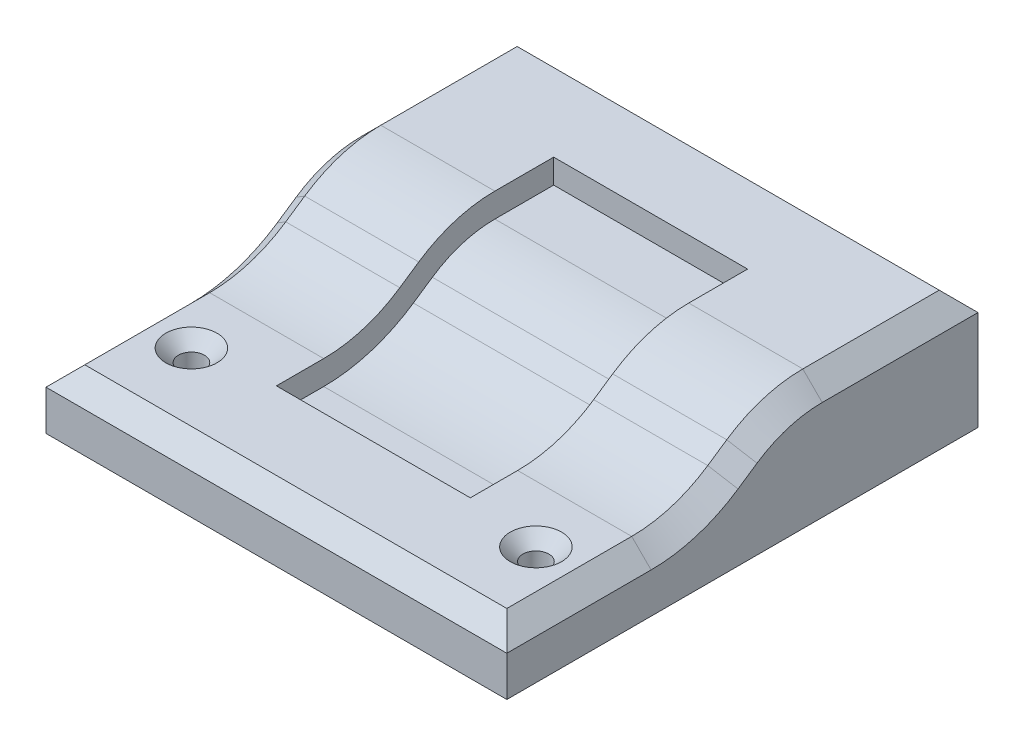
ISO-10303-21;
HEADER;
FILE_DESCRIPTION(('STEP AP214'),'2;1');
FILE_NAME('part.step','',(''),(''),'','','');
FILE_SCHEMA(('AUTOMOTIVE_DESIGN { 1 0 10303 214 1 1 1 1 }'));
ENDSEC;
DATA;
#1=APPLICATION_CONTEXT('core data for automotive mechanical design processes');
#2=APPLICATION_PROTOCOL_DEFINITION('international standard','automotive_design',2000,#1);
#3=PRODUCT_CONTEXT('',#1,'mechanical');
#4=PRODUCT('Part','Part','',(#3));
#5=PRODUCT_RELATED_PRODUCT_CATEGORY('part','',(#4));
#6=PRODUCT_DEFINITION_FORMATION('','',#4);
#7=PRODUCT_DEFINITION_CONTEXT('part definition',#1,'design');
#8=PRODUCT_DEFINITION('design','',#6,#7);
#9=PRODUCT_DEFINITION_SHAPE('','',#8);
#10=(LENGTH_UNIT() NAMED_UNIT(*) SI_UNIT(.MILLI.,.METRE.));
#11=(NAMED_UNIT(*) PLANE_ANGLE_UNIT() SI_UNIT($,.RADIAN.));
#12=(NAMED_UNIT(*) SI_UNIT($,.STERADIAN.) SOLID_ANGLE_UNIT());
#13=UNCERTAINTY_MEASURE_WITH_UNIT(LENGTH_MEASURE(1.E-05),#10,'distance_accuracy_value','');
#14=(GEOMETRIC_REPRESENTATION_CONTEXT(3) GLOBAL_UNCERTAINTY_ASSIGNED_CONTEXT((#13)) GLOBAL_UNIT_ASSIGNED_CONTEXT((#10,
#11,#12)) REPRESENTATION_CONTEXT('',''));
#15=CARTESIAN_POINT('',(0.,0.,0.));
#16=DIRECTION('',(0.,0.,1.));
#17=DIRECTION('',(1.,0.,0.));
#18=AXIS2_PLACEMENT_3D('',#15,#16,#17);
#19=CARTESIAN_POINT('',(-30.1832605408554,0.,37.3732017788698));
#20=DIRECTION('',(0.,-0.828233282410812,-0.560383466839461));
#21=DIRECTION('',(0.,0.560383466839461,-0.828233282410812));
#22=AXIS2_PLACEMENT_3D('',#19,#20,#21);
#23=PLANE('',#22);
#24=DIRECTION('',(1.,0.,0.));
#25=VECTOR('',#24,1.);
#26=CARTESIAN_POINT('',(-30.1832605408554,4.73659344972689,30.3726306120607));
#27=LINE('',#26,#25);
#28=CARTESIAN_POINT('',(27.6432605408554,4.73659344972689,30.3726306120607));
#29=VERTEX_POINT('',#28);
#30=CARTESIAN_POINT('',(12.7,4.73659344972689,30.3726306120607));
#31=VERTEX_POINT('',#30);
#32=EDGE_CURVE('E516',#29,#31,#27,.F.);
#33=ORIENTED_EDGE('',*,*,#32,.T.);
#34=DIRECTION('',(0.,-0.560383466839461,0.828233282410812));
#35=VECTOR('',#34,1.);
#36=CARTESIAN_POINT('',(12.7,0.,37.3732017788698));
#37=LINE('',#36,#35);
#38=CARTESIAN_POINT('',(12.7,3.05401223873577,32.8594451627497));
#39=VERTEX_POINT('',#38);
#40=EDGE_CURVE('E464',#31,#39,#37,.T.);
#41=ORIENTED_EDGE('',*,*,#40,.T.);
#42=DIRECTION('',(1.,0.,0.));
#43=VECTOR('',#42,1.);
#44=CARTESIAN_POINT('',(30.1832605408554,3.05401223873577,32.8594451627497));
#45=LINE('',#44,#43);
#46=CARTESIAN_POINT('',(27.6432605408554,3.05401223873577,32.8594451627497));
#47=VERTEX_POINT('',#46);
#48=EDGE_CURVE('E519',#39,#47,#45,.T.);
#49=ORIENTED_EDGE('',*,*,#48,.T.);
#50=DIRECTION('',(0.,0.560383466839461,-0.828233282410812));
#51=VECTOR('',#50,1.);
#52=CARTESIAN_POINT('',(27.6432605408554,0.,37.3732017788698));
#53=LINE('',#52,#51);
#54=EDGE_CURVE('E569',#47,#29,#53,.T.);
#55=ORIENTED_EDGE('',*,*,#54,.T.);
#56=EDGE_LOOP('',(#33,#41,#49,#55));
#57=FACE_BOUND('',#56,.T.);
#58=ADVANCED_FACE('F240',(#57),#23,.F.);
#59=CARTESIAN_POINT('',(-30.1832605408554,17.78,42.8230632031553));
#60=DIRECTION('',(-1.,0.,0.));
#61=DIRECTION('',(0.,0.,1.));
#62=AXIS2_PLACEMENT_3D('',#59,#60,#61);
#63=CYLINDRICAL_SURFACE('',#62,17.78);
#64=ORIENTED_EDGE('',*,*,#48,.F.);
#65=CARTESIAN_POINT('',(12.7,17.78,42.8230632031553));
#66=DIRECTION('',(1.,0.,0.));
#67=DIRECTION('',(0.,0.,-1.));
#68=AXIS2_PLACEMENT_3D('',#65,#66,#67);
#69=CIRCLE('',#68,17.78);
#70=CARTESIAN_POINT('',(12.7,0.,42.8230632031553));
#71=VERTEX_POINT('',#70);
#72=EDGE_CURVE('E470',#39,#71,#69,.F.);
#73=ORIENTED_EDGE('',*,*,#72,.T.);
#74=DIRECTION('',(1.,0.,0.));
#75=VECTOR('',#74,1.);
#76=CARTESIAN_POINT('',(-30.1832605408554,0.,42.8230632031553));
#77=LINE('',#76,#75);
#78=CARTESIAN_POINT('',(27.6432605408554,0.,42.8230632031553));
#79=VERTEX_POINT('',#78);
#80=EDGE_CURVE('E524',#79,#71,#77,.F.);
#81=ORIENTED_EDGE('',*,*,#80,.F.);
#82=CARTESIAN_POINT('',(27.6432605408554,17.78,42.8230632031553));
#83=DIRECTION('',(-1.,0.,0.));
#84=DIRECTION('',(0.,0.,1.));
#85=AXIS2_PLACEMENT_3D('',#82,#83,#84);
#86=CIRCLE('',#85,17.78);
#87=EDGE_CURVE('E564',#79,#47,#86,.F.);
#88=ORIENTED_EDGE('',*,*,#87,.T.);
#89=EDGE_LOOP('',(#64,#73,#81,#88));
#90=FACE_BOUND('',#89,.T.);
#91=ADVANCED_FACE('F625',(#90),#63,.F.);
#92=CARTESIAN_POINT('',(30.1832605408554,-9.98939431153734,20.4090125716551));
#93=DIRECTION('',(1.,0.,0.));
#94=DIRECTION('',(0.,0.,-1.));
#95=AXIS2_PLACEMENT_3D('',#92,#93,#94);
#96=CYLINDRICAL_SURFACE('',#95,17.78);
#97=CARTESIAN_POINT('',(12.7,-9.98939431153734,20.4090125716551));
#98=DIRECTION('',(1.,0.,0.));
#99=DIRECTION('',(0.,0.,-1.));
#100=AXIS2_PLACEMENT_3D('',#97,#98,#99);
#101=CIRCLE('',#100,17.78);
#102=CARTESIAN_POINT('',(12.7,7.79060568846266,20.4090125716551));
#103=VERTEX_POINT('',#102);
#104=EDGE_CURVE('E618',#31,#103,#101,.F.);
#105=ORIENTED_EDGE('',*,*,#104,.F.);
#106=ORIENTED_EDGE('',*,*,#32,.F.);
#107=CARTESIAN_POINT('',(27.6432605408554,-9.98939431153734,20.4090125716551));
#108=DIRECTION('',(-1.,0.,0.));
#109=DIRECTION('',(0.,0.,1.));
#110=AXIS2_PLACEMENT_3D('',#107,#108,#109);
#111=CIRCLE('',#110,17.78);
#112=CARTESIAN_POINT('',(27.6432605408554,7.79060568846265,20.4090125716551));
#113=VERTEX_POINT('',#112);
#114=EDGE_CURVE('E574',#29,#113,#111,.T.);
#115=ORIENTED_EDGE('',*,*,#114,.T.);
#116=DIRECTION('',(1.,0.,0.));
#117=VECTOR('',#116,1.);
#118=CARTESIAN_POINT('',(30.1832605408554,7.79060568846265,20.4090125716551));
#119=LINE('',#118,#117);
#120=EDGE_CURVE('E527',#103,#113,#119,.T.);
#121=ORIENTED_EDGE('',*,*,#120,.F.);
#122=EDGE_LOOP('',(#105,#106,#115,#121));
#123=FACE_BOUND('',#122,.T.);
#124=ADVANCED_FACE('F633',(#123),#96,.T.);
#125=CARTESIAN_POINT('',(-30.1832605408554,7.79060568846265,61.722));
#126=DIRECTION('',(1.,0.,0.));
#127=DIRECTION('',(0.,0.,-1.));
#128=AXIS2_PLACEMENT_3D('',#125,#126,#127);
#129=PLANE('',#128);
#130=DIRECTION('',(0.,-1.,0.));
#131=VECTOR('',#130,1.);
#132=CARTESIAN_POINT('',(-30.1832605408554,7.79060568846265,61.722));
#133=LINE('',#132,#131);
#134=CARTESIAN_POINT('',(-30.1832605408554,-2.53999999999999,61.722));
#135=VERTEX_POINT('',#134);
#136=CARTESIAN_POINT('',(-30.1832605408554,-7.79060568846265,61.722));
#137=VERTEX_POINT('',#136);
#138=EDGE_CURVE('E496',#135,#137,#133,.T.);
#139=ORIENTED_EDGE('',*,*,#138,.F.);
#140=DIRECTION('',(0.,0.,-1.));
#141=VECTOR('',#140,1.);
#142=CARTESIAN_POINT('',(-30.1832605408554,-2.53999999999999,61.722));
#143=LINE('',#142,#141);
#144=CARTESIAN_POINT('',(-30.1832605408554,-2.53999999999999,42.8230632031553));
#145=VERTEX_POINT('',#144);
#146=EDGE_CURVE('E559',#135,#145,#143,.T.);
#147=ORIENTED_EDGE('',*,*,#146,.T.);
#148=CARTESIAN_POINT('',(-30.1832605408554,17.78,42.8230632031553));
#149=DIRECTION('',(1.,0.,0.));
#150=DIRECTION('',(0.,0.,-1.));
#151=AXIS2_PLACEMENT_3D('',#148,#149,#150);
#152=CIRCLE('',#151,20.32);
#153=CARTESIAN_POINT('',(-30.1832605408554,0.950299701412311,31.4360711569775));
#154=VERTEX_POINT('',#153);
#155=EDGE_CURVE('E557',#145,#154,#152,.T.);
#156=ORIENTED_EDGE('',*,*,#155,.T.);
#157=DIRECTION('',(0.,0.560383466839461,-0.828233282410812));
#158=VECTOR('',#157,1.);
#159=CARTESIAN_POINT('',(-30.1832605408554,-10.9581963356475,49.0365418078644));
#160=LINE('',#159,#158);
#161=CARTESIAN_POINT('',(-30.1832605408554,2.63288091240343,28.9492566062885));
#162=VERTEX_POINT('',#161);
#163=EDGE_CURVE('E555',#154,#162,#160,.T.);
#164=ORIENTED_EDGE('',*,*,#163,.T.);
#165=CARTESIAN_POINT('',(-30.1832605408554,-9.98939431153734,20.4090125716551));
#166=DIRECTION('',(1.,0.,0.));
#167=DIRECTION('',(0.,0.,-1.));
#168=AXIS2_PLACEMENT_3D('',#165,#166,#167);
#169=CIRCLE('',#168,15.24);
#170=CARTESIAN_POINT('',(-30.1832605408554,5.25060568846266,20.4090125716551));
#171=VERTEX_POINT('',#170);
#172=EDGE_CURVE('E553',#162,#171,#169,.F.);
#173=ORIENTED_EDGE('',*,*,#172,.T.);
#174=DIRECTION('',(0.,0.,-1.));
#175=VECTOR('',#174,1.);
#176=CARTESIAN_POINT('',(-30.1832605408554,5.25060568846266,61.722));
#177=LINE('',#176,#175);
#178=CARTESIAN_POINT('',(-30.1832605408554,5.25060568846266,0.));
#179=VERTEX_POINT('',#178);
#180=EDGE_CURVE('E551',#171,#179,#177,.T.);
#181=ORIENTED_EDGE('',*,*,#180,.T.);
#182=DIRECTION('',(0.,-1.,0.));
#183=VECTOR('',#182,1.);
#184=CARTESIAN_POINT('',(-30.1832605408554,7.79060568846265,0.));
#185=LINE('',#184,#183);
#186=CARTESIAN_POINT('',(-30.1832605408554,-7.79060568846265,0.));
#187=VERTEX_POINT('',#186);
#188=EDGE_CURVE('E495',#179,#187,#185,.T.);
#189=ORIENTED_EDGE('',*,*,#188,.T.);
#190=DIRECTION('',(0.,0.,-1.));
#191=VECTOR('',#190,1.);
#192=CARTESIAN_POINT('',(-30.1832605408554,-7.79060568846265,61.722));
#193=LINE('',#192,#191);
#194=EDGE_CURVE('E512',#137,#187,#193,.T.);
#195=ORIENTED_EDGE('',*,*,#194,.F.);
#196=EDGE_LOOP('',(#139,#147,#156,#164,#173,#181,#189,#195));
#197=FACE_BOUND('',#196,.T.);
#198=ADVANCED_FACE('F745',(#197),#129,.F.);
#199=CARTESIAN_POINT('',(30.1832605408554,-7.79060568846265,61.722));
#200=DIRECTION('',(0.,1.,0.));
#201=DIRECTION('',(0.,0.,1.));
#202=AXIS2_PLACEMENT_3D('',#199,#200,#201);
#203=PLANE('',#202);
#204=CARTESIAN_POINT('',(-22.5632605408554,-7.79060568846265,50.292));
#205=DIRECTION('',(0.,1.,0.));
#206=DIRECTION('',(0.,0.,1.));
#207=AXIS2_PLACEMENT_3D('',#204,#205,#206);
#208=CIRCLE('',#207,1.7);
#209=CARTESIAN_POINT('',(-22.5632605408554,-7.79060568846265,51.992));
#210=VERTEX_POINT('',#209);
#211=EDGE_CURVE('E483',#210,#210,#208,.T.);
#212=ORIENTED_EDGE('',*,*,#211,.T.);
#213=EDGE_LOOP('',(#212));
#214=FACE_BOUND('',#213,.T.);
#215=CARTESIAN_POINT('',(22.5632605408554,-7.79060568846265,50.292));
#216=DIRECTION('',(0.,1.,0.));
#217=DIRECTION('',(0.,0.,1.));
#218=AXIS2_PLACEMENT_3D('',#215,#216,#217);
#219=CIRCLE('',#218,1.7);
#220=CARTESIAN_POINT('',(22.5632605408554,-7.79060568846265,51.992));
#221=VERTEX_POINT('',#220);
#222=EDGE_CURVE('E492',#221,#221,#219,.T.);
#223=ORIENTED_EDGE('',*,*,#222,.T.);
#224=EDGE_LOOP('',(#223));
#225=FACE_BOUND('',#224,.T.);
#226=DIRECTION('',(1.,0.,0.));
#227=VECTOR('',#226,1.);
#228=CARTESIAN_POINT('',(30.1832605408554,-7.79060568846265,0.));
#229=LINE('',#228,#227);
#230=CARTESIAN_POINT('',(30.1832605408554,-7.79060568846265,0.));
#231=VERTEX_POINT('',#230);
#232=EDGE_CURVE('E506',#187,#231,#229,.T.);
#233=ORIENTED_EDGE('',*,*,#232,.T.);
#234=DIRECTION('',(0.,0.,-1.));
#235=VECTOR('',#234,1.);
#236=CARTESIAN_POINT('',(30.1832605408554,-7.79060568846265,61.722));
#237=LINE('',#236,#235);
#238=CARTESIAN_POINT('',(30.1832605408554,-7.79060568846265,61.722));
#239=VERTEX_POINT('',#238);
#240=EDGE_CURVE('E504',#239,#231,#237,.T.);
#241=ORIENTED_EDGE('',*,*,#240,.F.);
#242=DIRECTION('',(1.,0.,0.));
#243=VECTOR('',#242,1.);
#244=CARTESIAN_POINT('',(30.1832605408554,-7.79060568846265,61.722));
#245=LINE('',#244,#243);
#246=EDGE_CURVE('E498',#137,#239,#245,.T.);
#247=ORIENTED_EDGE('',*,*,#246,.F.);
#248=ORIENTED_EDGE('',*,*,#194,.T.);
#249=EDGE_LOOP('',(#233,#241,#247,#248));
#250=FACE_BOUND('',#249,.T.);
#251=ADVANCED_FACE('F760',(#214,#225,#250),#203,.F.);
#252=CARTESIAN_POINT('',(30.1832605408554,7.79060568846265,61.722));
#253=DIRECTION('',(-1.,0.,0.));
#254=DIRECTION('',(0.,0.,1.));
#255=AXIS2_PLACEMENT_3D('',#252,#253,#254);
#256=PLANE('',#255);
#257=CARTESIAN_POINT('',(30.1832605408554,17.78,42.8230632031553));
#258=DIRECTION('',(-1.,0.,0.));
#259=DIRECTION('',(0.,0.,1.));
#260=AXIS2_PLACEMENT_3D('',#257,#258,#259);
#261=CIRCLE('',#260,20.32);
#262=CARTESIAN_POINT('',(30.1832605408554,0.950299701412309,31.4360711569775));
#263=VERTEX_POINT('',#262);
#264=CARTESIAN_POINT('',(30.1832605408554,-2.53999999999999,42.8230632031553));
#265=VERTEX_POINT('',#264);
#266=EDGE_CURVE('E547',#263,#265,#261,.T.);
#267=ORIENTED_EDGE('',*,*,#266,.T.);
#268=DIRECTION('',(0.,0.,1.));
#269=VECTOR('',#268,1.);
#270=CARTESIAN_POINT('',(30.1832605408554,-2.53999999999999,61.722));
#271=LINE('',#270,#269);
#272=CARTESIAN_POINT('',(30.1832605408554,-2.53999999999999,61.722));
#273=VERTEX_POINT('',#272);
#274=EDGE_CURVE('E549',#265,#273,#271,.T.);
#275=ORIENTED_EDGE('',*,*,#274,.T.);
#276=DIRECTION('',(0.,1.,0.));
#277=VECTOR('',#276,1.);
#278=CARTESIAN_POINT('',(30.1832605408554,7.79060568846265,61.722));
#279=LINE('',#278,#277);
#280=EDGE_CURVE('E501',#239,#273,#279,.T.);
#281=ORIENTED_EDGE('',*,*,#280,.F.);
#282=ORIENTED_EDGE('',*,*,#240,.T.);
#283=DIRECTION('',(0.,1.,0.));
#284=VECTOR('',#283,1.);
#285=CARTESIAN_POINT('',(30.1832605408554,7.79060568846265,0.));
#286=LINE('',#285,#284);
#287=CARTESIAN_POINT('',(30.1832605408554,5.25060568846266,0.));
#288=VERTEX_POINT('',#287);
#289=EDGE_CURVE('E499',#231,#288,#286,.T.);
#290=ORIENTED_EDGE('',*,*,#289,.T.);
#291=DIRECTION('',(0.,0.,1.));
#292=VECTOR('',#291,1.);
#293=CARTESIAN_POINT('',(30.1832605408554,5.25060568846266,61.722));
#294=LINE('',#293,#292);
#295=CARTESIAN_POINT('',(30.1832605408554,5.25060568846266,20.4090125716551));
#296=VERTEX_POINT('',#295);
#297=EDGE_CURVE('E541',#288,#296,#294,.T.);
#298=ORIENTED_EDGE('',*,*,#297,.T.);
#299=CARTESIAN_POINT('',(30.1832605408554,-9.98939431153734,20.4090125716551));
#300=DIRECTION('',(-1.,0.,0.));
#301=DIRECTION('',(0.,0.,1.));
#302=AXIS2_PLACEMENT_3D('',#299,#300,#301);
#303=CIRCLE('',#302,15.24);
#304=CARTESIAN_POINT('',(30.1832605408554,2.63288091240343,28.9492566062885));
#305=VERTEX_POINT('',#304);
#306=EDGE_CURVE('E543',#296,#305,#303,.F.);
#307=ORIENTED_EDGE('',*,*,#306,.T.);
#308=DIRECTION('',(0.,-0.560383466839461,0.828233282410812));
#309=VECTOR('',#308,1.);
#310=CARTESIAN_POINT('',(30.1832605408554,-10.9581963356475,49.0365418078644));
#311=LINE('',#310,#309);
#312=EDGE_CURVE('E545',#305,#263,#311,.T.);
#313=ORIENTED_EDGE('',*,*,#312,.T.);
#314=EDGE_LOOP('',(#267,#275,#281,#282,#290,#298,#307,#313));
#315=FACE_BOUND('',#314,.T.);
#316=ADVANCED_FACE('F754',(#315),#256,.F.);
#317=CARTESIAN_POINT('',(30.1832605408554,7.79060568846265,61.722));
#318=DIRECTION('',(0.,-1.,0.));
#319=DIRECTION('',(0.,0.,-1.));
#320=AXIS2_PLACEMENT_3D('',#317,#318,#319);
#321=PLANE('',#320);
#322=DIRECTION('',(1.,0.,0.));
#323=VECTOR('',#322,1.);
#324=CARTESIAN_POINT('',(30.1832605408554,7.79060568846265,12.7));
#325=LINE('',#324,#323);
#326=CARTESIAN_POINT('',(-12.7,7.79060568846265,12.7));
#327=VERTEX_POINT('',#326);
#328=CARTESIAN_POINT('',(12.7,7.79060568846265,12.7));
#329=VERTEX_POINT('',#328);
#330=EDGE_CURVE('E50',#327,#329,#325,.T.);
#331=ORIENTED_EDGE('',*,*,#330,.T.);
#332=DIRECTION('',(0.,0.,1.));
#333=VECTOR('',#332,1.);
#334=CARTESIAN_POINT('',(12.7,7.79060568846265,61.722));
#335=LINE('',#334,#333);
#336=EDGE_CURVE('E467',#329,#103,#335,.T.);
#337=ORIENTED_EDGE('',*,*,#336,.T.);
#338=ORIENTED_EDGE('',*,*,#120,.T.);
#339=DIRECTION('',(0.,0.,-1.));
#340=VECTOR('',#339,1.);
#341=CARTESIAN_POINT('',(27.6432605408554,7.79060568846265,61.722));
#342=LINE('',#341,#340);
#343=CARTESIAN_POINT('',(27.6432605408554,7.79060568846265,2.54));
#344=VERTEX_POINT('',#343);
#345=EDGE_CURVE('E263',#113,#344,#342,.T.);
#346=ORIENTED_EDGE('',*,*,#345,.T.);
#347=DIRECTION('',(-1.,0.,0.));
#348=VECTOR('',#347,1.);
#349=CARTESIAN_POINT('',(-30.1832605408554,7.79060568846265,2.54));
#350=LINE('',#349,#348);
#351=CARTESIAN_POINT('',(-27.6432605408554,7.79060568846265,2.54));
#352=VERTEX_POINT('',#351);
#353=EDGE_CURVE('E579',#344,#352,#350,.T.);
#354=ORIENTED_EDGE('',*,*,#353,.T.);
#355=DIRECTION('',(0.,0.,1.));
#356=VECTOR('',#355,1.);
#357=CARTESIAN_POINT('',(-27.6432605408554,7.79060568846265,61.722));
#358=LINE('',#357,#356);
#359=CARTESIAN_POINT('',(-27.6432605408554,7.79060568846265,20.4090125716551));
#360=VERTEX_POINT('',#359);
#361=EDGE_CURVE('E577',#352,#360,#358,.T.);
#362=ORIENTED_EDGE('',*,*,#361,.T.);
#363=CARTESIAN_POINT('',(-12.7,7.79060568846265,20.4090125716551));
#364=VERTEX_POINT('',#363);
#365=EDGE_CURVE('E528',#360,#364,#119,.T.);
#366=ORIENTED_EDGE('',*,*,#365,.T.);
#367=DIRECTION('',(0.,0.,-1.));
#368=VECTOR('',#367,1.);
#369=CARTESIAN_POINT('',(-12.7,7.79060568846265,61.722));
#370=LINE('',#369,#368);
#371=EDGE_CURVE('E255',#364,#327,#370,.T.);
#372=ORIENTED_EDGE('',*,*,#371,.T.);
#373=EDGE_LOOP('',(#331,#337,#338,#346,#354,#362,#366,#372));
#374=FACE_BOUND('',#373,.T.);
#375=ADVANCED_FACE('F635',(#374),#321,.F.);
#376=CARTESIAN_POINT('',(-30.1832605408554,-7.79060568846265,61.722));
#377=DIRECTION('',(0.,0.,-1.));
#378=DIRECTION('',(-1.,0.,0.));
#379=AXIS2_PLACEMENT_3D('',#376,#377,#378);
#380=PLANE('',#379);
#381=ORIENTED_EDGE('',*,*,#280,.T.);
#382=DIRECTION('',(-1.,0.,0.));
#383=VECTOR('',#382,1.);
#384=CARTESIAN_POINT('',(-30.1832605408554,-2.54000000000001,61.722));
#385=LINE('',#384,#383);
#386=EDGE_CURVE('E538',#273,#135,#385,.T.);
#387=ORIENTED_EDGE('',*,*,#386,.T.);
#388=ORIENTED_EDGE('',*,*,#138,.T.);
#389=ORIENTED_EDGE('',*,*,#246,.T.);
#390=EDGE_LOOP('',(#381,#387,#388,#389));
#391=FACE_BOUND('',#390,.T.);
#392=ADVANCED_FACE('F749',(#391),#380,.F.);
#393=CARTESIAN_POINT('',(-30.1832605408554,-7.79060568846265,0.));
#394=DIRECTION('',(0.,0.,-1.));
#395=DIRECTION('',(-1.,0.,0.));
#396=AXIS2_PLACEMENT_3D('',#393,#394,#395);
#397=PLANE('',#396);
#398=ORIENTED_EDGE('',*,*,#188,.F.);
#399=DIRECTION('',(1.,0.,0.));
#400=VECTOR('',#399,1.);
#401=CARTESIAN_POINT('',(30.1832605408554,5.25060568846266,0.));
#402=LINE('',#401,#400);
#403=EDGE_CURVE('E582',#179,#288,#402,.T.);
#404=ORIENTED_EDGE('',*,*,#403,.T.);
#405=ORIENTED_EDGE('',*,*,#289,.F.);
#406=ORIENTED_EDGE('',*,*,#232,.F.);
#407=EDGE_LOOP('',(#398,#404,#405,#406));
#408=FACE_BOUND('',#407,.T.);
#409=ADVANCED_FACE('F758',(#408),#397,.T.);
#410=CARTESIAN_POINT('',(-27.6432605408554,3.05401223873577,32.8594451627497));
#411=VERTEX_POINT('',#410);
#412=CARTESIAN_POINT('',(-12.7,3.05401223873577,32.8594451627497));
#413=VERTEX_POINT('',#412);
#414=EDGE_CURVE('E520',#411,#413,#45,.T.);
#415=ORIENTED_EDGE('',*,*,#414,.T.);
#416=DIRECTION('',(0.,0.560383466839461,-0.828233282410812));
#417=VECTOR('',#416,1.);
#418=CARTESIAN_POINT('',(-12.7,0.,37.3732017788698));
#419=LINE('',#418,#417);
#420=CARTESIAN_POINT('',(-12.7,4.73659344972689,30.3726306120607));
#421=VERTEX_POINT('',#420);
#422=EDGE_CURVE('E453',#413,#421,#419,.T.);
#423=ORIENTED_EDGE('',*,*,#422,.T.);
#424=CARTESIAN_POINT('',(-27.6432605408554,4.73659344972689,30.3726306120607));
#425=VERTEX_POINT('',#424);
#426=EDGE_CURVE('E515',#421,#425,#27,.F.);
#427=ORIENTED_EDGE('',*,*,#426,.T.);
#428=DIRECTION('',(0.,-0.560383466839461,0.828233282410812));
#429=VECTOR('',#428,1.);
#430=CARTESIAN_POINT('',(-27.6432605408554,0.,37.3732017788698));
#431=LINE('',#430,#429);
#432=EDGE_CURVE('E567',#425,#411,#431,.T.);
#433=ORIENTED_EDGE('',*,*,#432,.T.);
#434=EDGE_LOOP('',(#415,#423,#427,#433));
#435=FACE_BOUND('',#434,.T.);
#436=ADVANCED_FACE('F685',(#435),#23,.F.);
#437=CARTESIAN_POINT('',(-30.1832605408554,0.,61.722));
#438=DIRECTION('',(0.,-1.,0.));
#439=DIRECTION('',(0.,0.,-1.));
#440=AXIS2_PLACEMENT_3D('',#437,#438,#439);
#441=PLANE('',#440);
#442=CARTESIAN_POINT('',(-22.5632605408554,0.,50.292));
#443=DIRECTION('',(0.,1.,0.));
#444=DIRECTION('',(0.,0.,1.));
#445=AXIS2_PLACEMENT_3D('',#442,#443,#444);
#446=CIRCLE('',#445,3.36);
#447=CARTESIAN_POINT('',(-22.5632605408554,0.,53.652));
#448=VERTEX_POINT('',#447);
#449=EDGE_CURVE('E476',#448,#448,#446,.T.);
#450=ORIENTED_EDGE('',*,*,#449,.F.);
#451=EDGE_LOOP('',(#450));
#452=FACE_BOUND('',#451,.T.);
#453=CARTESIAN_POINT('',(22.5632605408554,0.,50.292));
#454=DIRECTION('',(0.,1.,0.));
#455=DIRECTION('',(0.,0.,1.));
#456=AXIS2_PLACEMENT_3D('',#453,#454,#455);
#457=CIRCLE('',#456,3.36);
#458=CARTESIAN_POINT('',(22.5632605408554,0.,53.652));
#459=VERTEX_POINT('',#458);
#460=EDGE_CURVE('E486',#459,#459,#457,.T.);
#461=ORIENTED_EDGE('',*,*,#460,.F.);
#462=EDGE_LOOP('',(#461));
#463=FACE_BOUND('',#462,.T.);
#464=ORIENTED_EDGE('',*,*,#80,.T.);
#465=DIRECTION('',(0.,0.,1.));
#466=VECTOR('',#465,1.);
#467=CARTESIAN_POINT('',(12.7,0.,61.722));
#468=LINE('',#467,#466);
#469=CARTESIAN_POINT('',(12.7,0.,49.022));
#470=VERTEX_POINT('',#469);
#471=EDGE_CURVE('E473',#71,#470,#468,.T.);
#472=ORIENTED_EDGE('',*,*,#471,.T.);
#473=DIRECTION('',(-1.,0.,0.));
#474=VECTOR('',#473,1.);
#475=CARTESIAN_POINT('',(-30.1832605408554,0.,49.022));
#476=LINE('',#475,#474);
#477=CARTESIAN_POINT('',(-12.7,0.,49.022));
#478=VERTEX_POINT('',#477);
#479=EDGE_CURVE('E248',#470,#478,#476,.T.);
#480=ORIENTED_EDGE('',*,*,#479,.T.);
#481=DIRECTION('',(0.,0.,-1.));
#482=VECTOR('',#481,1.);
#483=CARTESIAN_POINT('',(-12.7,0.,61.722));
#484=LINE('',#483,#482);
#485=CARTESIAN_POINT('',(-12.7,0.,42.8230632031553));
#486=VERTEX_POINT('',#485);
#487=EDGE_CURVE('E461',#478,#486,#484,.T.);
#488=ORIENTED_EDGE('',*,*,#487,.T.);
#489=CARTESIAN_POINT('',(-27.6432605408554,0.,42.8230632031553));
#490=VERTEX_POINT('',#489);
#491=EDGE_CURVE('E523',#486,#490,#77,.F.);
#492=ORIENTED_EDGE('',*,*,#491,.T.);
#493=DIRECTION('',(0.,0.,1.));
#494=VECTOR('',#493,1.);
#495=CARTESIAN_POINT('',(-27.6432605408554,0.,61.722));
#496=LINE('',#495,#494);
#497=CARTESIAN_POINT('',(-27.6432605408554,0.,59.182));
#498=VERTEX_POINT('',#497);
#499=EDGE_CURVE('E531',#490,#498,#496,.T.);
#500=ORIENTED_EDGE('',*,*,#499,.T.);
#501=DIRECTION('',(1.,0.,0.));
#502=VECTOR('',#501,1.);
#503=CARTESIAN_POINT('',(-30.1832605408554,0.,59.182));
#504=LINE('',#503,#502);
#505=CARTESIAN_POINT('',(27.6432605408554,0.,59.182));
#506=VERTEX_POINT('',#505);
#507=EDGE_CURVE('E533',#498,#506,#504,.T.);
#508=ORIENTED_EDGE('',*,*,#507,.T.);
#509=DIRECTION('',(0.,0.,-1.));
#510=VECTOR('',#509,1.);
#511=CARTESIAN_POINT('',(27.6432605408554,0.,61.722));
#512=LINE('',#511,#510);
#513=EDGE_CURVE('E536',#506,#79,#512,.T.);
#514=ORIENTED_EDGE('',*,*,#513,.T.);
#515=EDGE_LOOP('',(#464,#472,#480,#488,#492,#500,#508,#514));
#516=FACE_BOUND('',#515,.T.);
#517=ADVANCED_FACE('F620',(#452,#463,#516),#441,.F.);
#518=ORIENTED_EDGE('',*,*,#491,.F.);
#519=CARTESIAN_POINT('',(-12.7,17.78,42.8230632031553));
#520=DIRECTION('',(-1.,0.,0.));
#521=DIRECTION('',(0.,0.,1.));
#522=AXIS2_PLACEMENT_3D('',#519,#520,#521);
#523=CIRCLE('',#522,17.78);
#524=EDGE_CURVE('E458',#486,#413,#523,.F.);
#525=ORIENTED_EDGE('',*,*,#524,.T.);
#526=ORIENTED_EDGE('',*,*,#414,.F.);
#527=CARTESIAN_POINT('',(-27.6432605408554,17.78,42.8230632031553));
#528=DIRECTION('',(1.,0.,0.));
#529=DIRECTION('',(0.,0.,-1.));
#530=AXIS2_PLACEMENT_3D('',#527,#528,#529);
#531=CIRCLE('',#530,17.78);
#532=EDGE_CURVE('E561',#411,#490,#531,.F.);
#533=ORIENTED_EDGE('',*,*,#532,.T.);
#534=EDGE_LOOP('',(#518,#525,#526,#533));
#535=FACE_BOUND('',#534,.T.);
#536=ADVANCED_FACE('F682',(#535),#63,.F.);
#537=CARTESIAN_POINT('',(-12.7,-9.98939431153734,20.4090125716551));
#538=DIRECTION('',(-1.,0.,0.));
#539=DIRECTION('',(0.,0.,1.));
#540=AXIS2_PLACEMENT_3D('',#537,#538,#539);
#541=CIRCLE('',#540,17.78);
#542=EDGE_CURVE('E584',#364,#421,#541,.F.);
#543=ORIENTED_EDGE('',*,*,#542,.F.);
#544=ORIENTED_EDGE('',*,*,#365,.F.);
#545=CARTESIAN_POINT('',(-27.6432605408554,-9.98939431153734,20.4090125716551));
#546=DIRECTION('',(1.,0.,0.));
#547=DIRECTION('',(0.,0.,-1.));
#548=AXIS2_PLACEMENT_3D('',#545,#546,#547);
#549=CIRCLE('',#548,17.78);
#550=EDGE_CURVE('E571',#360,#425,#549,.T.);
#551=ORIENTED_EDGE('',*,*,#550,.T.);
#552=ORIENTED_EDGE('',*,*,#426,.F.);
#553=EDGE_LOOP('',(#543,#544,#551,#552));
#554=FACE_BOUND('',#553,.T.);
#555=ADVANCED_FACE('F736',(#554),#96,.T.);
#556=CARTESIAN_POINT('',(22.5632605408554,0.,50.292));
#557=DIRECTION('',(0.,1.,0.));
#558=DIRECTION('',(0.,0.,1.));
#559=AXIS2_PLACEMENT_3D('',#556,#557,#558);
#560=CYLINDRICAL_SURFACE('',#559,1.7);
#561=ORIENTED_EDGE('',*,*,#222,.F.);
#562=EDGE_LOOP('',(#561));
#563=FACE_BOUND('',#562,.T.);
#564=CARTESIAN_POINT('',(22.5632605408554,-1.66,50.292));
#565=DIRECTION('',(0.,1.,0.));
#566=DIRECTION('',(0.,0.,1.));
#567=AXIS2_PLACEMENT_3D('',#564,#565,#566);
#568=CIRCLE('',#567,1.7);
#569=CARTESIAN_POINT('',(22.5632605408554,-1.66,51.992));
#570=VERTEX_POINT('',#569);
#571=EDGE_CURVE('E489',#570,#570,#568,.T.);
#572=ORIENTED_EDGE('',*,*,#571,.T.);
#573=EDGE_LOOP('',(#572));
#574=FACE_BOUND('',#573,.T.);
#575=ADVANCED_FACE('F899',(#563,#574),#560,.F.);
#576=CARTESIAN_POINT('',(22.5632605408554,0.,50.292));
#577=DIRECTION('',(0.,1.,0.));
#578=DIRECTION('',(0.,0.,1.));
#579=AXIS2_PLACEMENT_3D('',#576,#577,#578);
#580=CONICAL_SURFACE('',#579,3.36,0.785398163397447);
#581=ORIENTED_EDGE('',*,*,#571,.F.);
#582=EDGE_LOOP('',(#581));
#583=FACE_BOUND('',#582,.T.);
#584=ORIENTED_EDGE('',*,*,#460,.T.);
#585=EDGE_LOOP('',(#584));
#586=FACE_BOUND('',#585,.T.);
#587=ADVANCED_FACE('F896',(#583,#586),#580,.F.);
#588=CARTESIAN_POINT('',(-22.5632605408554,0.,50.292));
#589=DIRECTION('',(0.,1.,0.));
#590=DIRECTION('',(0.,0.,1.));
#591=AXIS2_PLACEMENT_3D('',#588,#589,#590);
#592=CYLINDRICAL_SURFACE('',#591,1.7);
#593=ORIENTED_EDGE('',*,*,#211,.F.);
#594=EDGE_LOOP('',(#593));
#595=FACE_BOUND('',#594,.T.);
#596=CARTESIAN_POINT('',(-22.5632605408554,-1.66,50.292));
#597=DIRECTION('',(0.,1.,0.));
#598=DIRECTION('',(0.,0.,1.));
#599=AXIS2_PLACEMENT_3D('',#596,#597,#598);
#600=CIRCLE('',#599,1.7);
#601=CARTESIAN_POINT('',(-22.5632605408554,-1.66,51.992));
#602=VERTEX_POINT('',#601);
#603=EDGE_CURVE('E479',#602,#602,#600,.T.);
#604=ORIENTED_EDGE('',*,*,#603,.T.);
#605=EDGE_LOOP('',(#604));
#606=FACE_BOUND('',#605,.T.);
#607=ADVANCED_FACE('F892',(#595,#606),#592,.F.);
#608=CARTESIAN_POINT('',(-22.5632605408554,0.,50.292));
#609=DIRECTION('',(0.,1.,0.));
#610=DIRECTION('',(0.,0.,1.));
#611=AXIS2_PLACEMENT_3D('',#608,#609,#610);
#612=CONICAL_SURFACE('',#611,3.36,0.785398163397447);
#613=ORIENTED_EDGE('',*,*,#603,.F.);
#614=EDGE_LOOP('',(#613));
#615=FACE_BOUND('',#614,.T.);
#616=ORIENTED_EDGE('',*,*,#449,.T.);
#617=EDGE_LOOP('',(#616));
#618=FACE_BOUND('',#617,.T.);
#619=ADVANCED_FACE('F889',(#615,#618),#612,.F.);
#620=CARTESIAN_POINT('',(30.1832605408554,7.79060568846265,2.54));
#621=DIRECTION('',(0.,0.707106781186549,-0.707106781186546));
#622=DIRECTION('',(0.,0.707106781186546,0.707106781186549));
#623=AXIS2_PLACEMENT_3D('',#620,#621,#622);
#624=PLANE('',#623);
#625=DIRECTION('',(-0.577350269189627,0.577350269189624,0.577350269189626));
#626=VECTOR('',#625,1.);
#627=CARTESIAN_POINT('',(28.489927207522,6.94393902179599,1.69333333333333));
#628=LINE('',#627,#626);
#629=EDGE_CURVE('E612',#288,#344,#628,.T.);
#630=ORIENTED_EDGE('',*,*,#629,.F.);
#631=ORIENTED_EDGE('',*,*,#403,.F.);
#632=DIRECTION('',(0.577350269189627,0.577350269189625,0.577350269189626));
#633=VECTOR('',#632,1.);
#634=CARTESIAN_POINT('',(-9.60926054085533,25.8246056884626,20.574));
#635=LINE('',#634,#633);
#636=EDGE_CURVE('E480',#352,#179,#635,.F.);
#637=ORIENTED_EDGE('',*,*,#636,.F.);
#638=ORIENTED_EDGE('',*,*,#353,.F.);
#639=EDGE_LOOP('',(#630,#631,#637,#638));
#640=FACE_BOUND('',#639,.T.);
#641=ADVANCED_FACE('F242',(#640),#624,.T.);
#642=CARTESIAN_POINT('',(-30.1832605408554,5.25060568846266,61.722));
#643=DIRECTION('',(0.707106781186546,-0.707106781186549,0.));
#644=DIRECTION('',(0.707106781186549,0.707106781186546,0.));
#645=AXIS2_PLACEMENT_3D('',#642,#643,#644);
#646=PLANE('',#645);
#647=ORIENTED_EDGE('',*,*,#636,.T.);
#648=ORIENTED_EDGE('',*,*,#180,.F.);
#649=DIRECTION('',(-0.707106781186549,-0.707106781186546,0.));
#650=VECTOR('',#649,1.);
#651=CARTESIAN_POINT('',(-27.6432605408554,7.79060568846265,20.4090125716551));
#652=LINE('',#651,#650);
#653=EDGE_CURVE('E609',#360,#171,#652,.T.);
#654=ORIENTED_EDGE('',*,*,#653,.F.);
#655=ORIENTED_EDGE('',*,*,#361,.F.);
#656=EDGE_LOOP('',(#647,#648,#654,#655));
#657=FACE_BOUND('',#656,.T.);
#658=ADVANCED_FACE('F739',(#657),#646,.F.);
#659=CARTESIAN_POINT('',(27.6432605408554,7.79060568846265,61.722));
#660=DIRECTION('',(-0.707106781186546,-0.707106781186549,0.));
#661=DIRECTION('',(0.707106781186549,-0.707106781186546,0.));
#662=AXIS2_PLACEMENT_3D('',#659,#660,#661);
#663=PLANE('',#662);
#664=ORIENTED_EDGE('',*,*,#629,.T.);
#665=ORIENTED_EDGE('',*,*,#345,.F.);
#666=DIRECTION('',(-0.707106781186549,0.707106781186546,0.));
#667=VECTOR('',#666,1.);
#668=CARTESIAN_POINT('',(30.1832605408554,5.25060568846266,20.4090125716551));
#669=LINE('',#668,#667);
#670=EDGE_CURVE('E606',#296,#113,#669,.T.);
#671=ORIENTED_EDGE('',*,*,#670,.F.);
#672=ORIENTED_EDGE('',*,*,#297,.F.);
#673=EDGE_LOOP('',(#664,#665,#671,#672));
#674=FACE_BOUND('',#673,.T.);
#675=ADVANCED_FACE('F726',(#674),#663,.F.);
#676=CARTESIAN_POINT('',(-30.1832605408554,-9.98939431153734,20.4090125716551));
#677=DIRECTION('',(1.,0.,0.));
#678=DIRECTION('',(0.,0.,-1.));
#679=AXIS2_PLACEMENT_3D('',#676,#677,#678);
#680=CONICAL_SURFACE('',#679,15.24,0.785398163397447);
#681=ORIENTED_EDGE('',*,*,#653,.T.);
#682=ORIENTED_EDGE('',*,*,#172,.F.);
#683=DIRECTION('',(-0.707106781186548,-0.585649370397077,-0.396250949467009));
#684=VECTOR('',#683,1.);
#685=CARTESIAN_POINT('',(-27.6432605408554,4.73659344972689,30.3726306120607));
#686=LINE('',#685,#684);
#687=EDGE_CURVE('E603',#425,#162,#686,.T.);
#688=ORIENTED_EDGE('',*,*,#687,.F.);
#689=ORIENTED_EDGE('',*,*,#550,.F.);
#690=EDGE_LOOP('',(#681,#682,#688,#689));
#691=FACE_BOUND('',#690,.T.);
#692=ADVANCED_FACE('F742',(#691),#680,.T.);
#693=CARTESIAN_POINT('',(30.1832605408554,-9.98939431153734,20.4090125716551));
#694=DIRECTION('',(-1.,0.,0.));
#695=DIRECTION('',(0.,0.,1.));
#696=AXIS2_PLACEMENT_3D('',#693,#694,#695);
#697=CONICAL_SURFACE('',#696,15.24,0.785398163397447);
#698=ORIENTED_EDGE('',*,*,#670,.T.);
#699=ORIENTED_EDGE('',*,*,#114,.F.);
#700=DIRECTION('',(-0.707106781186548,0.585649370397077,0.396250949467009));
#701=VECTOR('',#700,1.);
#702=CARTESIAN_POINT('',(30.1832605408554,2.63288091240343,28.9492566062885));
#703=LINE('',#702,#701);
#704=EDGE_CURVE('E600',#305,#29,#703,.T.);
#705=ORIENTED_EDGE('',*,*,#704,.F.);
#706=ORIENTED_EDGE('',*,*,#306,.F.);
#707=EDGE_LOOP('',(#698,#699,#705,#706));
#708=FACE_BOUND('',#707,.T.);
#709=ADVANCED_FACE('F722',(#708),#697,.T.);
#710=CARTESIAN_POINT('',(-30.1832605408554,-10.9581963356475,49.0365418078644));
#711=DIRECTION('',(0.707106781186548,-0.585649370397078,-0.396250949467009));
#712=DIRECTION('',(0.637863438423379,0.770149488036383,0.));
#713=AXIS2_PLACEMENT_3D('',#710,#711,#712);
#714=PLANE('',#713);
#715=ORIENTED_EDGE('',*,*,#687,.T.);
#716=ORIENTED_EDGE('',*,*,#163,.F.);
#717=DIRECTION('',(-0.707106781186548,-0.585649370397078,-0.396250949467009));
#718=VECTOR('',#717,1.);
#719=CARTESIAN_POINT('',(-27.6432605408554,3.05401223873577,32.8594451627497));
#720=LINE('',#719,#718);
#721=EDGE_CURVE('E597',#411,#154,#720,.T.);
#722=ORIENTED_EDGE('',*,*,#721,.F.);
#723=ORIENTED_EDGE('',*,*,#432,.F.);
#724=EDGE_LOOP('',(#715,#716,#722,#723));
#725=FACE_BOUND('',#724,.T.);
#726=ADVANCED_FACE('F689',(#725),#714,.F.);
#727=CARTESIAN_POINT('',(27.6432605408554,0.,37.3732017788698));
#728=DIRECTION('',(-0.707106781186549,-0.585649370397077,-0.396250949467009));
#729=DIRECTION('',(0.637863438423378,-0.770149488036384,0.));
#730=AXIS2_PLACEMENT_3D('',#727,#728,#729);
#731=PLANE('',#730);
#732=ORIENTED_EDGE('',*,*,#704,.T.);
#733=ORIENTED_EDGE('',*,*,#54,.F.);
#734=DIRECTION('',(-0.707106781186546,0.585649370397079,0.396250949467011));
#735=VECTOR('',#734,1.);
#736=CARTESIAN_POINT('',(30.1832605408554,0.950299701412309,31.4360711569775));
#737=LINE('',#736,#735);
#738=EDGE_CURVE('E594',#263,#47,#737,.T.);
#739=ORIENTED_EDGE('',*,*,#738,.F.);
#740=ORIENTED_EDGE('',*,*,#312,.F.);
#741=EDGE_LOOP('',(#732,#733,#739,#740));
#742=FACE_BOUND('',#741,.T.);
#743=ADVANCED_FACE('F718',(#742),#731,.F.);
#744=CARTESIAN_POINT('',(-30.1832605408554,17.78,42.8230632031553));
#745=DIRECTION('',(-1.,0.,0.));
#746=DIRECTION('',(0.,0.,1.));
#747=AXIS2_PLACEMENT_3D('',#744,#745,#746);
#748=CONICAL_SURFACE('',#747,20.32,0.785398163397447);
#749=ORIENTED_EDGE('',*,*,#721,.T.);
#750=ORIENTED_EDGE('',*,*,#155,.F.);
#751=DIRECTION('',(-0.707106781186548,-0.707106781186547,0.));
#752=VECTOR('',#751,1.);
#753=CARTESIAN_POINT('',(-27.6432605408554,0.,42.8230632031553));
#754=LINE('',#753,#752);
#755=EDGE_CURVE('E591',#490,#145,#754,.T.);
#756=ORIENTED_EDGE('',*,*,#755,.F.);
#757=ORIENTED_EDGE('',*,*,#532,.F.);
#758=EDGE_LOOP('',(#749,#750,#756,#757));
#759=FACE_BOUND('',#758,.T.);
#760=ADVANCED_FACE('F696',(#759),#748,.F.);
#761=CARTESIAN_POINT('',(30.1832605408554,17.78,42.8230632031553));
#762=DIRECTION('',(1.,0.,0.));
#763=DIRECTION('',(0.,0.,-1.));
#764=AXIS2_PLACEMENT_3D('',#761,#762,#763);
#765=CONICAL_SURFACE('',#764,20.32,0.785398163397447);
#766=ORIENTED_EDGE('',*,*,#738,.T.);
#767=ORIENTED_EDGE('',*,*,#87,.F.);
#768=DIRECTION('',(-0.707106781186548,0.707106781186547,0.));
#769=VECTOR('',#768,1.);
#770=CARTESIAN_POINT('',(30.1832605408554,-2.53999999999999,42.8230632031553));
#771=LINE('',#770,#769);
#772=EDGE_CURVE('E588',#265,#79,#771,.T.);
#773=ORIENTED_EDGE('',*,*,#772,.F.);
#774=ORIENTED_EDGE('',*,*,#266,.F.);
#775=EDGE_LOOP('',(#766,#767,#773,#774));
#776=FACE_BOUND('',#775,.T.);
#777=ADVANCED_FACE('F714',(#776),#765,.F.);
#778=CARTESIAN_POINT('',(-30.1832605408554,-2.53999999999999,61.722));
#779=DIRECTION('',(0.707106781186547,-0.707106781186548,0.));
#780=DIRECTION('',(0.707106781186548,0.707106781186547,0.));
#781=AXIS2_PLACEMENT_3D('',#778,#779,#780);
#782=PLANE('',#781);
#783=ORIENTED_EDGE('',*,*,#755,.T.);
#784=ORIENTED_EDGE('',*,*,#146,.F.);
#785=DIRECTION('',(0.577350269189627,0.577350269189626,-0.577350269189624));
#786=VECTOR('',#785,1.);
#787=CARTESIAN_POINT('',(-30.1832605408554,-2.54,61.722));
#788=LINE('',#787,#786);
#789=EDGE_CURVE('E586',#498,#135,#788,.F.);
#790=ORIENTED_EDGE('',*,*,#789,.F.);
#791=ORIENTED_EDGE('',*,*,#499,.F.);
#792=EDGE_LOOP('',(#783,#784,#790,#791));
#793=FACE_BOUND('',#792,.T.);
#794=ADVANCED_FACE('F701',(#793),#782,.F.);
#795=CARTESIAN_POINT('',(27.6432605408554,0.,61.722));
#796=DIRECTION('',(-0.707106781186547,-0.707106781186548,0.));
#797=DIRECTION('',(0.707106781186548,-0.707106781186547,0.));
#798=AXIS2_PLACEMENT_3D('',#795,#796,#797);
#799=PLANE('',#798);
#800=ORIENTED_EDGE('',*,*,#772,.T.);
#801=ORIENTED_EDGE('',*,*,#513,.F.);
#802=DIRECTION('',(0.577350269189627,-0.577350269189626,0.577350269189624));
#803=VECTOR('',#802,1.);
#804=CARTESIAN_POINT('',(28.489927207522,-0.846666666666665,60.0286666666666));
#805=LINE('',#804,#803);
#806=EDGE_CURVE('E475',#273,#506,#805,.F.);
#807=ORIENTED_EDGE('',*,*,#806,.F.);
#808=ORIENTED_EDGE('',*,*,#274,.F.);
#809=EDGE_LOOP('',(#800,#801,#807,#808));
#810=FACE_BOUND('',#809,.T.);
#811=ADVANCED_FACE('F710',(#810),#799,.F.);
#812=CARTESIAN_POINT('',(-30.1832605408554,0.,59.182));
#813=DIRECTION('',(0.,-0.707106781186547,-0.707106781186548));
#814=DIRECTION('',(0.,0.707106781186548,-0.707106781186547));
#815=AXIS2_PLACEMENT_3D('',#812,#813,#814);
#816=PLANE('',#815);
#817=ORIENTED_EDGE('',*,*,#789,.T.);
#818=ORIENTED_EDGE('',*,*,#386,.F.);
#819=ORIENTED_EDGE('',*,*,#806,.T.);
#820=ORIENTED_EDGE('',*,*,#507,.F.);
#821=EDGE_LOOP('',(#817,#818,#819,#820));
#822=FACE_BOUND('',#821,.T.);
#823=ADVANCED_FACE('F705',(#822),#816,.F.);
#824=CARTESIAN_POINT('',(12.7,-14.1416056884627,12.7));
#825=DIRECTION('',(0.,0.,-1.));
#826=DIRECTION('',(-1.,0.,0.));
#827=AXIS2_PLACEMENT_3D('',#824,#825,#826);
#828=PLANE('',#827);
#829=DIRECTION('',(0.,1.,0.));
#830=VECTOR('',#829,1.);
#831=CARTESIAN_POINT('',(-12.7,-14.1416056884627,12.7));
#832=LINE('',#831,#830);
#833=CARTESIAN_POINT('',(-12.7,4.61560568846265,12.7));
#834=VERTEX_POINT('',#833);
#835=EDGE_CURVE('E438',#834,#327,#832,.T.);
#836=ORIENTED_EDGE('',*,*,#835,.F.);
#837=DIRECTION('',(-1.,0.,0.));
#838=VECTOR('',#837,1.);
#839=CARTESIAN_POINT('',(12.7,4.61560568846265,12.7));
#840=LINE('',#839,#838);
#841=CARTESIAN_POINT('',(12.7,4.61560568846265,12.7));
#842=VERTEX_POINT('',#841);
#843=EDGE_CURVE('E452',#842,#834,#840,.T.);
#844=ORIENTED_EDGE('',*,*,#843,.F.);
#845=DIRECTION('',(0.,1.,0.));
#846=VECTOR('',#845,1.);
#847=CARTESIAN_POINT('',(12.7,-14.1416056884627,12.7));
#848=LINE('',#847,#846);
#849=EDGE_CURVE('E432',#842,#329,#848,.T.);
#850=ORIENTED_EDGE('',*,*,#849,.T.);
#851=ORIENTED_EDGE('',*,*,#330,.F.);
#852=EDGE_LOOP('',(#836,#844,#850,#851));
#853=FACE_BOUND('',#852,.T.);
#854=ADVANCED_FACE('F640',(#853),#828,.F.);
#855=CARTESIAN_POINT('',(12.7,-14.1416056884627,49.022));
#856=DIRECTION('',(0.,0.,1.));
#857=DIRECTION('',(1.,0.,0.));
#858=AXIS2_PLACEMENT_3D('',#855,#856,#857);
#859=PLANE('',#858);
#860=DIRECTION('',(0.,1.,0.));
#861=VECTOR('',#860,1.);
#862=CARTESIAN_POINT('',(12.7,-14.1416056884627,49.022));
#863=LINE('',#862,#861);
#864=CARTESIAN_POINT('',(12.7,-3.175,49.022));
#865=VERTEX_POINT('',#864);
#866=EDGE_CURVE('E417',#865,#470,#863,.T.);
#867=ORIENTED_EDGE('',*,*,#866,.F.);
#868=DIRECTION('',(1.,0.,0.));
#869=VECTOR('',#868,1.);
#870=CARTESIAN_POINT('',(12.7,-3.175,49.022));
#871=LINE('',#870,#869);
#872=CARTESIAN_POINT('',(-12.7,-3.175,49.022));
#873=VERTEX_POINT('',#872);
#874=EDGE_CURVE('E425',#873,#865,#871,.T.);
#875=ORIENTED_EDGE('',*,*,#874,.F.);
#876=DIRECTION('',(0.,1.,0.));
#877=VECTOR('',#876,1.);
#878=CARTESIAN_POINT('',(-12.7,-14.1416056884627,49.022));
#879=LINE('',#878,#877);
#880=EDGE_CURVE('E433',#873,#478,#879,.T.);
#881=ORIENTED_EDGE('',*,*,#880,.T.);
#882=ORIENTED_EDGE('',*,*,#479,.F.);
#883=EDGE_LOOP('',(#867,#875,#881,#882));
#884=FACE_BOUND('',#883,.T.);
#885=ADVANCED_FACE('F428',(#884),#859,.F.);
#886=CARTESIAN_POINT('',(12.7,-14.1416056884627,12.7));
#887=DIRECTION('',(1.,0.,0.));
#888=DIRECTION('',(0.,0.,-1.));
#889=AXIS2_PLACEMENT_3D('',#886,#887,#888);
#890=PLANE('',#889);
#891=ORIENTED_EDGE('',*,*,#72,.F.);
#892=ORIENTED_EDGE('',*,*,#40,.F.);
#893=ORIENTED_EDGE('',*,*,#104,.T.);
#894=ORIENTED_EDGE('',*,*,#336,.F.);
#895=ORIENTED_EDGE('',*,*,#849,.F.);
#896=DIRECTION('',(0.,0.,-1.));
#897=VECTOR('',#896,1.);
#898=CARTESIAN_POINT('',(12.7,4.61560568846265,12.7));
#899=LINE('',#898,#897);
#900=CARTESIAN_POINT('',(12.7,4.61560568846265,20.4090125716551));
#901=VERTEX_POINT('',#900);
#902=EDGE_CURVE('E449',#901,#842,#899,.T.);
#903=ORIENTED_EDGE('',*,*,#902,.F.);
#904=CARTESIAN_POINT('',(12.7,-9.98939431153734,20.4090125716551));
#905=DIRECTION('',(1.,0.,0.));
#906=DIRECTION('',(0.,0.,-1.));
#907=AXIS2_PLACEMENT_3D('',#904,#905,#906);
#908=CIRCLE('',#907,14.605);
#909=CARTESIAN_POINT('',(12.7,2.10695277807256,28.5934131048454));
#910=VERTEX_POINT('',#909);
#911=EDGE_CURVE('E447',#901,#910,#908,.T.);
#912=ORIENTED_EDGE('',*,*,#911,.T.);
#913=DIRECTION('',(0.,0.560383466839461,-0.828233282410812));
#914=VECTOR('',#913,1.);
#915=CARTESIAN_POINT('',(12.7,4.38100579883329,25.2324174488111));
#916=LINE('',#915,#914);
#917=CARTESIAN_POINT('',(12.7,0.424371567081446,31.0802276555344));
#918=VERTEX_POINT('',#917);
#919=EDGE_CURVE('E444',#918,#910,#916,.T.);
#920=ORIENTED_EDGE('',*,*,#919,.F.);
#921=CARTESIAN_POINT('',(12.7,17.78,42.8230632031553));
#922=DIRECTION('',(1.,0.,0.));
#923=DIRECTION('',(0.,0.,-1.));
#924=AXIS2_PLACEMENT_3D('',#921,#922,#923);
#925=CIRCLE('',#924,20.955);
#926=CARTESIAN_POINT('',(12.7,-3.175,42.8230632031553));
#927=VERTEX_POINT('',#926);
#928=EDGE_CURVE('E420',#927,#918,#925,.T.);
#929=ORIENTED_EDGE('',*,*,#928,.F.);
#930=DIRECTION('',(0.,0.,-1.));
#931=VECTOR('',#930,1.);
#932=CARTESIAN_POINT('',(12.7,-3.175,12.7));
#933=LINE('',#932,#931);
#934=EDGE_CURVE('E414',#865,#927,#933,.T.);
#935=ORIENTED_EDGE('',*,*,#934,.F.);
#936=ORIENTED_EDGE('',*,*,#866,.T.);
#937=ORIENTED_EDGE('',*,*,#471,.F.);
#938=EDGE_LOOP('',(#891,#892,#893,#894,#895,#903,#912,#920,#929,#935,#936,#937));
#939=FACE_BOUND('',#938,.T.);
#940=ADVANCED_FACE('F416',(#939),#890,.F.);
#941=CARTESIAN_POINT('',(-12.7,-14.1416056884627,12.7));
#942=DIRECTION('',(-1.,0.,0.));
#943=DIRECTION('',(0.,0.,1.));
#944=AXIS2_PLACEMENT_3D('',#941,#942,#943);
#945=PLANE('',#944);
#946=ORIENTED_EDGE('',*,*,#880,.F.);
#947=DIRECTION('',(0.,0.,1.));
#948=VECTOR('',#947,1.);
#949=CARTESIAN_POINT('',(-12.7,-3.175,12.7));
#950=LINE('',#949,#948);
#951=CARTESIAN_POINT('',(-12.7,-3.175,42.8230632031553));
#952=VERTEX_POINT('',#951);
#953=EDGE_CURVE('E436',#952,#873,#950,.T.);
#954=ORIENTED_EDGE('',*,*,#953,.F.);
#955=CARTESIAN_POINT('',(-12.7,17.78,42.8230632031553));
#956=DIRECTION('',(-1.,0.,0.));
#957=DIRECTION('',(0.,0.,1.));
#958=AXIS2_PLACEMENT_3D('',#955,#956,#957);
#959=CIRCLE('',#958,20.955);
#960=CARTESIAN_POINT('',(-12.7,0.424371567081446,31.0802276555344));
#961=VERTEX_POINT('',#960);
#962=EDGE_CURVE('E653',#961,#952,#959,.T.);
#963=ORIENTED_EDGE('',*,*,#962,.F.);
#964=DIRECTION('',(0.,-0.560383466839461,0.828233282410812));
#965=VECTOR('',#964,1.);
#966=CARTESIAN_POINT('',(-12.7,4.38100579883329,25.2324174488111));
#967=LINE('',#966,#965);
#968=CARTESIAN_POINT('',(-12.7,2.10695277807256,28.5934131048454));
#969=VERTEX_POINT('',#968);
#970=EDGE_CURVE('E650',#969,#961,#967,.T.);
#971=ORIENTED_EDGE('',*,*,#970,.F.);
#972=CARTESIAN_POINT('',(-12.7,-9.98939431153734,20.4090125716551));
#973=DIRECTION('',(-1.,0.,0.));
#974=DIRECTION('',(0.,0.,1.));
#975=AXIS2_PLACEMENT_3D('',#972,#973,#974);
#976=CIRCLE('',#975,14.605);
#977=CARTESIAN_POINT('',(-12.7,4.61560568846265,20.4090125716551));
#978=VERTEX_POINT('',#977);
#979=EDGE_CURVE('E647',#969,#978,#976,.T.);
#980=ORIENTED_EDGE('',*,*,#979,.T.);
#981=DIRECTION('',(0.,0.,1.));
#982=VECTOR('',#981,1.);
#983=CARTESIAN_POINT('',(-12.7,4.61560568846265,12.7));
#984=LINE('',#983,#982);
#985=EDGE_CURVE('E644',#834,#978,#984,.T.);
#986=ORIENTED_EDGE('',*,*,#985,.F.);
#987=ORIENTED_EDGE('',*,*,#835,.T.);
#988=ORIENTED_EDGE('',*,*,#371,.F.);
#989=ORIENTED_EDGE('',*,*,#542,.T.);
#990=ORIENTED_EDGE('',*,*,#422,.F.);
#991=ORIENTED_EDGE('',*,*,#524,.F.);
#992=ORIENTED_EDGE('',*,*,#487,.F.);
#993=EDGE_LOOP('',(#946,#954,#963,#971,#980,#986,#987,#988,#989,#990,#991,#992));
#994=FACE_BOUND('',#993,.T.);
#995=ADVANCED_FACE('F679',(#994),#945,.F.);
#996=CARTESIAN_POINT('',(30.1832605408554,4.61560568846265,61.722));
#997=DIRECTION('',(0.,-1.,0.));
#998=DIRECTION('',(0.,0.,-1.));
#999=AXIS2_PLACEMENT_3D('',#996,#997,#998);
#1000=PLANE('',#999);
#1001=ORIENTED_EDGE('',*,*,#843,.T.);
#1002=ORIENTED_EDGE('',*,*,#985,.T.);
#1003=DIRECTION('',(1.,0.,0.));
#1004=VECTOR('',#1003,1.);
#1005=CARTESIAN_POINT('',(30.1832605408554,4.61560568846265,20.4090125716551));
#1006=LINE('',#1005,#1004);
#1007=EDGE_CURVE('E656',#978,#901,#1006,.T.);
#1008=ORIENTED_EDGE('',*,*,#1007,.T.);
#1009=ORIENTED_EDGE('',*,*,#902,.T.);
#1010=EDGE_LOOP('',(#1001,#1002,#1008,#1009));
#1011=FACE_BOUND('',#1010,.T.);
#1012=ADVANCED_FACE('F669',(#1011),#1000,.F.);
#1013=CARTESIAN_POINT('',(30.1832605408554,-9.98939431153734,20.4090125716551));
#1014=DIRECTION('',(1.,0.,0.));
#1015=DIRECTION('',(0.,0.,-1.));
#1016=AXIS2_PLACEMENT_3D('',#1013,#1014,#1015);
#1017=CYLINDRICAL_SURFACE('',#1016,14.605);
#1018=ORIENTED_EDGE('',*,*,#979,.F.);
#1019=DIRECTION('',(1.,0.,0.));
#1020=VECTOR('',#1019,1.);
#1021=CARTESIAN_POINT('',(-30.1832605408554,2.10695277807256,28.5934131048454));
#1022=LINE('',#1021,#1020);
#1023=EDGE_CURVE('E662',#910,#969,#1022,.F.);
#1024=ORIENTED_EDGE('',*,*,#1023,.F.);
#1025=ORIENTED_EDGE('',*,*,#911,.F.);
#1026=ORIENTED_EDGE('',*,*,#1007,.F.);
#1027=EDGE_LOOP('',(#1018,#1024,#1025,#1026));
#1028=FACE_BOUND('',#1027,.T.);
#1029=ADVANCED_FACE('F673',(#1028),#1017,.T.);
#1030=CARTESIAN_POINT('',(-30.1832605408554,-2.62964067165433,35.5939842716545));
#1031=DIRECTION('',(0.,-0.828233282410812,-0.560383466839461));
#1032=DIRECTION('',(0.,0.560383466839461,-0.828233282410812));
#1033=AXIS2_PLACEMENT_3D('',#1030,#1031,#1032);
#1034=PLANE('',#1033);
#1035=ORIENTED_EDGE('',*,*,#1023,.T.);
#1036=ORIENTED_EDGE('',*,*,#970,.T.);
#1037=DIRECTION('',(1.,0.,0.));
#1038=VECTOR('',#1037,1.);
#1039=CARTESIAN_POINT('',(-30.1832605408554,0.424371567081446,31.0802276555344));
#1040=LINE('',#1039,#1038);
#1041=EDGE_CURVE('E659',#961,#918,#1040,.T.);
#1042=ORIENTED_EDGE('',*,*,#1041,.T.);
#1043=ORIENTED_EDGE('',*,*,#919,.T.);
#1044=EDGE_LOOP('',(#1035,#1036,#1042,#1043));
#1045=FACE_BOUND('',#1044,.T.);
#1046=ADVANCED_FACE('F676',(#1045),#1034,.F.);
#1047=CARTESIAN_POINT('',(-30.1832605408554,17.78,42.8230632031553));
#1048=DIRECTION('',(-1.,0.,0.));
#1049=DIRECTION('',(0.,0.,1.));
#1050=AXIS2_PLACEMENT_3D('',#1047,#1048,#1049);
#1051=CYLINDRICAL_SURFACE('',#1050,20.955);
#1052=ORIENTED_EDGE('',*,*,#1041,.F.);
#1053=ORIENTED_EDGE('',*,*,#962,.T.);
#1054=DIRECTION('',(1.,0.,0.));
#1055=VECTOR('',#1054,1.);
#1056=CARTESIAN_POINT('',(-30.1832605408554,-3.175,42.8230632031553));
#1057=LINE('',#1056,#1055);
#1058=EDGE_CURVE('E456',#927,#952,#1057,.F.);
#1059=ORIENTED_EDGE('',*,*,#1058,.F.);
#1060=ORIENTED_EDGE('',*,*,#928,.T.);
#1061=EDGE_LOOP('',(#1052,#1053,#1059,#1060));
#1062=FACE_BOUND('',#1061,.T.);
#1063=ADVANCED_FACE('F678',(#1062),#1051,.F.);
#1064=CARTESIAN_POINT('',(-30.1832605408554,-3.175,61.722));
#1065=DIRECTION('',(0.,-1.,0.));
#1066=DIRECTION('',(0.,0.,-1.));
#1067=AXIS2_PLACEMENT_3D('',#1064,#1065,#1066);
#1068=PLANE('',#1067);
#1069=ORIENTED_EDGE('',*,*,#1058,.T.);
#1070=ORIENTED_EDGE('',*,*,#953,.T.);
#1071=ORIENTED_EDGE('',*,*,#874,.T.);
#1072=ORIENTED_EDGE('',*,*,#934,.T.);
#1073=EDGE_LOOP('',(#1069,#1070,#1071,#1072));
#1074=FACE_BOUND('',#1073,.T.);
#1075=ADVANCED_FACE('F435',(#1074),#1068,.F.);
#1076=CLOSED_SHELL('',(#58,#91,#124,#198,#251,#316,#375,#392,#409,#436,#517,#536,#555,#575,#587,
#607,#619,#641,#658,#675,#692,#709,#726,#743,#760,#777,#794,#811,#823,#854,#885,#940,#995,#1012,
#1029,#1046,#1063,#1075));
#1077=MANIFOLD_SOLID_BREP('B8',#1076);
#1078=ADVANCED_BREP_SHAPE_REPRESENTATION('',(#18,#1077),#14);
#1079=SHAPE_DEFINITION_REPRESENTATION(#9,#1078);
ENDSEC;
END-ISO-10303-21;
